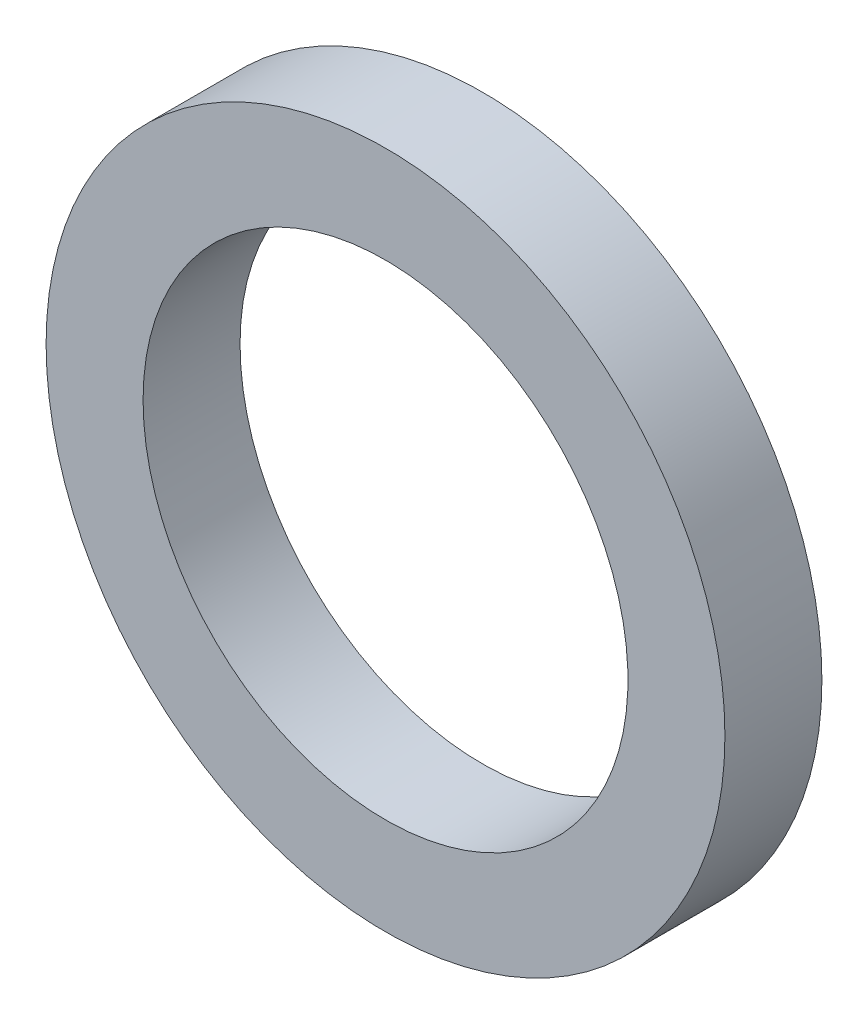
ISO-10303-21;
HEADER;
FILE_DESCRIPTION(('STEP AP214'),'2;1');
FILE_NAME('part.step','',(''),(''),'','','');
FILE_SCHEMA(('AUTOMOTIVE_DESIGN { 1 0 10303 214 1 1 1 1 }'));
ENDSEC;
DATA;
#1=APPLICATION_CONTEXT('core data for automotive mechanical design processes');
#2=APPLICATION_PROTOCOL_DEFINITION('international standard','automotive_design',2000,#1);
#3=PRODUCT_CONTEXT('',#1,'mechanical');
#4=PRODUCT('Part','Part','',(#3));
#5=PRODUCT_RELATED_PRODUCT_CATEGORY('part','',(#4));
#6=PRODUCT_DEFINITION_FORMATION('','',#4);
#7=PRODUCT_DEFINITION_CONTEXT('part definition',#1,'design');
#8=PRODUCT_DEFINITION('design','',#6,#7);
#9=PRODUCT_DEFINITION_SHAPE('','',#8);
#10=(LENGTH_UNIT() NAMED_UNIT(*) SI_UNIT(.MILLI.,.METRE.));
#11=(NAMED_UNIT(*) PLANE_ANGLE_UNIT() SI_UNIT($,.RADIAN.));
#12=(NAMED_UNIT(*) SI_UNIT($,.STERADIAN.) SOLID_ANGLE_UNIT());
#13=UNCERTAINTY_MEASURE_WITH_UNIT(LENGTH_MEASURE(1.E-05),#10,'distance_accuracy_value','');
#14=(GEOMETRIC_REPRESENTATION_CONTEXT(3) GLOBAL_UNCERTAINTY_ASSIGNED_CONTEXT((#13)) GLOBAL_UNIT_ASSIGNED_CONTEXT((#10,
#11,#12)) REPRESENTATION_CONTEXT('',''));
#15=CARTESIAN_POINT('',(0.,0.,0.));
#16=DIRECTION('',(0.,0.,1.));
#17=DIRECTION('',(1.,0.,0.));
#18=AXIS2_PLACEMENT_3D('',#15,#16,#17);
#19=CARTESIAN_POINT('',(0.,0.,48.));
#20=DIRECTION('',(0.,0.,-1.));
#21=DIRECTION('',(-1.,0.,0.));
#22=AXIS2_PLACEMENT_3D('',#19,#20,#21);
#23=PLANE('',#22);
#24=CARTESIAN_POINT('',(0.,0.,48.));
#25=DIRECTION('',(0.,0.,-1.));
#26=DIRECTION('',(-1.,0.,0.));
#27=AXIS2_PLACEMENT_3D('',#24,#25,#26);
#28=CIRCLE('',#27,7.);
#29=CARTESIAN_POINT('',(-7.,0.,48.));
#30=VERTEX_POINT('',#29);
#31=EDGE_CURVE('E10',#30,#30,#28,.T.);
#32=ORIENTED_EDGE('',*,*,#31,.T.);
#33=EDGE_LOOP('',(#32));
#34=FACE_BOUND('',#33,.T.);
#35=CARTESIAN_POINT('',(0.,0.,48.));
#36=DIRECTION('',(0.,0.,-1.));
#37=DIRECTION('',(-1.,0.,0.));
#38=AXIS2_PLACEMENT_3D('',#35,#36,#37);
#39=CIRCLE('',#38,5.);
#40=CARTESIAN_POINT('',(-5.,0.,48.));
#41=VERTEX_POINT('',#40);
#42=EDGE_CURVE('E50',#41,#41,#39,.T.);
#43=ORIENTED_EDGE('',*,*,#42,.F.);
#44=EDGE_LOOP('',(#43));
#45=FACE_BOUND('',#44,.T.);
#46=ADVANCED_FACE('F39',(#34,#45),#23,.T.);
#47=CARTESIAN_POINT('',(0.,0.,50.));
#48=DIRECTION('',(0.,0.,-1.));
#49=DIRECTION('',(-1.,0.,0.));
#50=AXIS2_PLACEMENT_3D('',#47,#48,#49);
#51=PLANE('',#50);
#52=CARTESIAN_POINT('',(0.,0.,50.));
#53=DIRECTION('',(0.,0.,-1.));
#54=DIRECTION('',(-1.,0.,0.));
#55=AXIS2_PLACEMENT_3D('',#52,#53,#54);
#56=CIRCLE('',#55,7.);
#57=CARTESIAN_POINT('',(-7.,0.,50.));
#58=VERTEX_POINT('',#57);
#59=EDGE_CURVE('E43',#58,#58,#56,.T.);
#60=ORIENTED_EDGE('',*,*,#59,.F.);
#61=EDGE_LOOP('',(#60));
#62=FACE_BOUND('',#61,.T.);
#63=CARTESIAN_POINT('',(0.,0.,50.));
#64=DIRECTION('',(0.,0.,-1.));
#65=DIRECTION('',(-1.,0.,0.));
#66=AXIS2_PLACEMENT_3D('',#63,#64,#65);
#67=CIRCLE('',#66,5.);
#68=CARTESIAN_POINT('',(-5.,0.,50.));
#69=VERTEX_POINT('',#68);
#70=EDGE_CURVE('E52',#69,#69,#67,.T.);
#71=ORIENTED_EDGE('',*,*,#70,.T.);
#72=EDGE_LOOP('',(#71));
#73=FACE_BOUND('',#72,.T.);
#74=ADVANCED_FACE('F62',(#62,#73),#51,.F.);
#75=CARTESIAN_POINT('',(0.,0.,48.));
#76=DIRECTION('',(0.,0.,1.));
#77=DIRECTION('',(1.,0.,0.));
#78=AXIS2_PLACEMENT_3D('',#75,#76,#77);
#79=CYLINDRICAL_SURFACE('',#78,7.);
#80=ORIENTED_EDGE('',*,*,#31,.F.);
#81=EDGE_LOOP('',(#80));
#82=FACE_BOUND('',#81,.T.);
#83=ORIENTED_EDGE('',*,*,#59,.T.);
#84=EDGE_LOOP('',(#83));
#85=FACE_BOUND('',#84,.T.);
#86=ADVANCED_FACE('F41',(#82,#85),#79,.T.);
#87=CARTESIAN_POINT('',(0.,0.,48.));
#88=DIRECTION('',(0.,0.,1.));
#89=DIRECTION('',(1.,0.,0.));
#90=AXIS2_PLACEMENT_3D('',#87,#88,#89);
#91=CYLINDRICAL_SURFACE('',#90,5.);
#92=ORIENTED_EDGE('',*,*,#42,.T.);
#93=EDGE_LOOP('',(#92));
#94=FACE_BOUND('',#93,.T.);
#95=ORIENTED_EDGE('',*,*,#70,.F.);
#96=EDGE_LOOP('',(#95));
#97=FACE_BOUND('',#96,.T.);
#98=ADVANCED_FACE('F58',(#94,#97),#91,.F.);
#99=CLOSED_SHELL('',(#46,#74,#86,#98));
#100=MANIFOLD_SOLID_BREP('B2',#99);
#101=ADVANCED_BREP_SHAPE_REPRESENTATION('',(#18,#100),#14);
#102=SHAPE_DEFINITION_REPRESENTATION(#9,#101);
ENDSEC;
END-ISO-10303-21;
